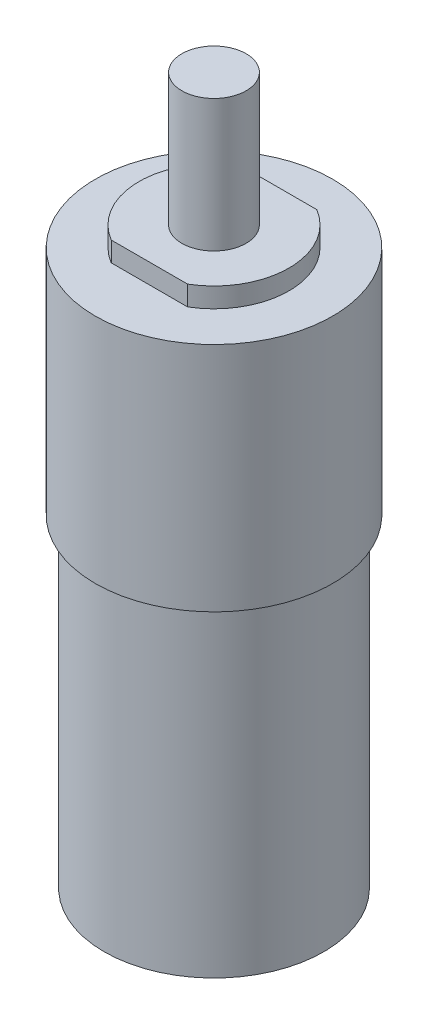
ISO-10303-21;
HEADER;
FILE_DESCRIPTION(('STEP AP214'),'2;1');
FILE_NAME('part.step','',(''),(''),'','','');
FILE_SCHEMA(('AUTOMOTIVE_DESIGN { 1 0 10303 214 1 1 1 1 }'));
ENDSEC;
DATA;
#1=APPLICATION_CONTEXT('core data for automotive mechanical design processes');
#2=APPLICATION_PROTOCOL_DEFINITION('international standard','automotive_design',2000,#1);
#3=PRODUCT_CONTEXT('',#1,'mechanical');
#4=PRODUCT('Part','Part','',(#3));
#5=PRODUCT_RELATED_PRODUCT_CATEGORY('part','',(#4));
#6=PRODUCT_DEFINITION_FORMATION('','',#4);
#7=PRODUCT_DEFINITION_CONTEXT('part definition',#1,'design');
#8=PRODUCT_DEFINITION('design','',#6,#7);
#9=PRODUCT_DEFINITION_SHAPE('','',#8);
#10=(LENGTH_UNIT() NAMED_UNIT(*) SI_UNIT(.MILLI.,.METRE.));
#11=(NAMED_UNIT(*) PLANE_ANGLE_UNIT() SI_UNIT($,.RADIAN.));
#12=(NAMED_UNIT(*) SI_UNIT($,.STERADIAN.) SOLID_ANGLE_UNIT());
#13=UNCERTAINTY_MEASURE_WITH_UNIT(LENGTH_MEASURE(1.E-05),#10,'distance_accuracy_value','');
#14=(GEOMETRIC_REPRESENTATION_CONTEXT(3) GLOBAL_UNCERTAINTY_ASSIGNED_CONTEXT((#13)) GLOBAL_UNIT_ASSIGNED_CONTEXT((#10,
#11,#12)) REPRESENTATION_CONTEXT('',''));
#15=CARTESIAN_POINT('',(0.,0.,0.));
#16=DIRECTION('',(0.,0.,1.));
#17=DIRECTION('',(1.,0.,0.));
#18=AXIS2_PLACEMENT_3D('',#15,#16,#17);
#19=CARTESIAN_POINT('',(0.,53.1368,0.));
#20=DIRECTION('',(0.,-1.,0.));
#21=DIRECTION('',(0.,0.,-1.));
#22=AXIS2_PLACEMENT_3D('',#19,#20,#21);
#23=CYLINDRICAL_SURFACE('',#22,6.9342);
#24=CARTESIAN_POINT('',(0.,53.1368,0.));
#25=DIRECTION('',(0.,1.,0.));
#26=DIRECTION('',(0.,0.,1.));
#27=AXIS2_PLACEMENT_3D('',#24,#25,#26);
#28=CIRCLE('',#27,6.9342);
#29=CARTESIAN_POINT('',(-3.52904642077715,53.1368,-5.969));
#30=VERTEX_POINT('',#29);
#31=CARTESIAN_POINT('',(-3.5290464207772,53.1368,5.969));
#32=VERTEX_POINT('',#31);
#33=EDGE_CURVE('E98',#30,#32,#28,.T.);
#34=ORIENTED_EDGE('',*,*,#33,.F.);
#35=DIRECTION('',(0.,1.,0.));
#36=VECTOR('',#35,1.);
#37=CARTESIAN_POINT('',(-3.5290464207772,44.1842169039195,-5.969));
#38=LINE('',#37,#36);
#39=CARTESIAN_POINT('',(-3.5290464207772,51.308,-5.969));
#40=VERTEX_POINT('',#39);
#41=EDGE_CURVE('E53',#40,#30,#38,.T.);
#42=ORIENTED_EDGE('',*,*,#41,.F.);
#43=CARTESIAN_POINT('',(0.,51.308,0.));
#44=DIRECTION('',(0.,1.,0.));
#45=DIRECTION('',(0.,0.,1.));
#46=AXIS2_PLACEMENT_3D('',#43,#44,#45);
#47=CIRCLE('',#46,6.9342);
#48=CARTESIAN_POINT('',(-3.5290464207772,51.308,5.969));
#49=VERTEX_POINT('',#48);
#50=EDGE_CURVE('E45',#40,#49,#47,.T.);
#51=ORIENTED_EDGE('',*,*,#50,.T.);
#52=DIRECTION('',(0.,1.,0.));
#53=VECTOR('',#52,1.);
#54=CARTESIAN_POINT('',(-3.5290464207772,44.1842169039195,5.969));
#55=LINE('',#54,#53);
#56=EDGE_CURVE('E163',#49,#32,#55,.T.);
#57=ORIENTED_EDGE('',*,*,#56,.T.);
#58=EDGE_LOOP('',(#34,#42,#51,#57));
#59=FACE_BOUND('',#58,.T.);
#60=ADVANCED_FACE('F36',(#59),#23,.T.);
#61=CARTESIAN_POINT('',(0.,29.8958,0.));
#62=DIRECTION('',(0.,-1.,0.));
#63=DIRECTION('',(0.,0.,-1.));
#64=AXIS2_PLACEMENT_3D('',#61,#62,#63);
#65=CYLINDRICAL_SURFACE('',#64,10.16);
#66=CARTESIAN_POINT('',(0.,29.8958,0.));
#67=DIRECTION('',(0.,1.,0.));
#68=DIRECTION('',(0.,0.,1.));
#69=AXIS2_PLACEMENT_3D('',#66,#67,#68);
#70=CIRCLE('',#69,10.16);
#71=CARTESIAN_POINT('',(0.,29.8958,10.16));
#72=VERTEX_POINT('',#71);
#73=EDGE_CURVE('E110',#72,#72,#70,.T.);
#74=ORIENTED_EDGE('',*,*,#73,.F.);
#75=EDGE_LOOP('',(#74));
#76=FACE_BOUND('',#75,.T.);
#77=CARTESIAN_POINT('',(0.,0.,0.));
#78=DIRECTION('',(0.,1.,0.));
#79=DIRECTION('',(0.,0.,1.));
#80=AXIS2_PLACEMENT_3D('',#77,#78,#79);
#81=CIRCLE('',#80,10.16);
#82=CARTESIAN_POINT('',(0.,0.,10.16));
#83=VERTEX_POINT('',#82);
#84=EDGE_CURVE('E108',#83,#83,#81,.T.);
#85=ORIENTED_EDGE('',*,*,#84,.T.);
#86=EDGE_LOOP('',(#85));
#87=FACE_BOUND('',#86,.T.);
#88=ADVANCED_FACE('F38',(#76,#87),#65,.T.);
#89=CARTESIAN_POINT('',(0.,0.,0.));
#90=DIRECTION('',(0.,1.,0.));
#91=DIRECTION('',(0.,0.,1.));
#92=AXIS2_PLACEMENT_3D('',#89,#90,#91);
#93=PLANE('',#92);
#94=ORIENTED_EDGE('',*,*,#84,.F.);
#95=EDGE_LOOP('',(#94));
#96=FACE_BOUND('',#95,.T.);
#97=ADVANCED_FACE('F116',(#96),#93,.F.);
#98=CARTESIAN_POINT('',(0.,51.308,0.));
#99=DIRECTION('',(0.,-1.,0.));
#100=DIRECTION('',(0.,0.,-1.));
#101=AXIS2_PLACEMENT_3D('',#98,#99,#100);
#102=CYLINDRICAL_SURFACE('',#101,10.9728);
#103=CARTESIAN_POINT('',(0.,51.308,0.));
#104=DIRECTION('',(0.,1.,0.));
#105=DIRECTION('',(0.,0.,1.));
#106=AXIS2_PLACEMENT_3D('',#103,#104,#105);
#107=CIRCLE('',#106,10.9728);
#108=CARTESIAN_POINT('',(0.,51.308,10.9728));
#109=VERTEX_POINT('',#108);
#110=EDGE_CURVE('E101',#109,#109,#107,.T.);
#111=ORIENTED_EDGE('',*,*,#110,.F.);
#112=EDGE_LOOP('',(#111));
#113=FACE_BOUND('',#112,.T.);
#114=CARTESIAN_POINT('',(0.,29.8958,0.));
#115=DIRECTION('',(0.,1.,0.));
#116=DIRECTION('',(0.,0.,1.));
#117=AXIS2_PLACEMENT_3D('',#114,#115,#116);
#118=CIRCLE('',#117,10.9728);
#119=CARTESIAN_POINT('',(0.,29.8958,10.9728));
#120=VERTEX_POINT('',#119);
#121=EDGE_CURVE('E97',#120,#120,#118,.T.);
#122=ORIENTED_EDGE('',*,*,#121,.T.);
#123=EDGE_LOOP('',(#122));
#124=FACE_BOUND('',#123,.T.);
#125=ADVANCED_FACE('F118',(#113,#124),#102,.T.);
#126=CARTESIAN_POINT('',(0.,51.308,0.));
#127=DIRECTION('',(0.,1.,0.));
#128=DIRECTION('',(0.,0.,1.));
#129=AXIS2_PLACEMENT_3D('',#126,#127,#128);
#130=PLANE('',#129);
#131=CARTESIAN_POINT('',(3.5290464207772,51.308,5.969));
#132=VERTEX_POINT('',#131);
#133=CARTESIAN_POINT('',(3.5290464207772,51.308,-5.969));
#134=VERTEX_POINT('',#133);
#135=EDGE_CURVE('E11',#132,#134,#47,.T.);
#136=ORIENTED_EDGE('',*,*,#135,.F.);
#137=DIRECTION('',(1.,0.,0.));
#138=VECTOR('',#137,1.);
#139=CARTESIAN_POINT('',(3.5290464207772,51.308,5.969));
#140=LINE('',#139,#138);
#141=EDGE_CURVE('E85',#49,#132,#140,.T.);
#142=ORIENTED_EDGE('',*,*,#141,.F.);
#143=ORIENTED_EDGE('',*,*,#50,.F.);
#144=DIRECTION('',(-1.,0.,0.));
#145=VECTOR('',#144,1.);
#146=CARTESIAN_POINT('',(-3.5290464207772,51.308,-5.969));
#147=LINE('',#146,#145);
#148=EDGE_CURVE('E92',#134,#40,#147,.T.);
#149=ORIENTED_EDGE('',*,*,#148,.F.);
#150=EDGE_LOOP('',(#136,#142,#143,#149));
#151=FACE_BOUND('',#150,.T.);
#152=ORIENTED_EDGE('',*,*,#110,.T.);
#153=EDGE_LOOP('',(#152));
#154=FACE_BOUND('',#153,.T.);
#155=ADVANCED_FACE('F123',(#151,#154),#130,.T.);
#156=CARTESIAN_POINT('',(0.,29.8958,0.));
#157=DIRECTION('',(0.,1.,0.));
#158=DIRECTION('',(0.,0.,1.));
#159=AXIS2_PLACEMENT_3D('',#156,#157,#158);
#160=PLANE('',#159);
#161=ORIENTED_EDGE('',*,*,#73,.T.);
#162=EDGE_LOOP('',(#161));
#163=FACE_BOUND('',#162,.T.);
#164=ORIENTED_EDGE('',*,*,#121,.F.);
#165=EDGE_LOOP('',(#164));
#166=FACE_BOUND('',#165,.T.);
#167=ADVANCED_FACE('F135',(#163,#166),#160,.F.);
#168=ORIENTED_EDGE('',*,*,#135,.T.);
#169=DIRECTION('',(0.,1.,0.));
#170=VECTOR('',#169,1.);
#171=CARTESIAN_POINT('',(3.5290464207772,44.1842169039195,-5.969));
#172=LINE('',#171,#170);
#173=CARTESIAN_POINT('',(3.5290464207772,53.1368,-5.969));
#174=VERTEX_POINT('',#173);
#175=EDGE_CURVE('E79',#134,#174,#172,.T.);
#176=ORIENTED_EDGE('',*,*,#175,.T.);
#177=CARTESIAN_POINT('',(3.52904642077715,53.1368,5.969));
#178=VERTEX_POINT('',#177);
#179=EDGE_CURVE('E90',#178,#174,#28,.T.);
#180=ORIENTED_EDGE('',*,*,#179,.F.);
#181=DIRECTION('',(0.,1.,0.));
#182=VECTOR('',#181,1.);
#183=CARTESIAN_POINT('',(3.5290464207772,44.1842169039195,5.969));
#184=LINE('',#183,#182);
#185=EDGE_CURVE('E61',#132,#178,#184,.T.);
#186=ORIENTED_EDGE('',*,*,#185,.F.);
#187=EDGE_LOOP('',(#168,#176,#180,#186));
#188=FACE_BOUND('',#187,.T.);
#189=ADVANCED_FACE('F89',(#188),#23,.T.);
#190=CARTESIAN_POINT('',(0.,53.1368,0.));
#191=DIRECTION('',(0.,1.,0.));
#192=DIRECTION('',(0.,0.,1.));
#193=AXIS2_PLACEMENT_3D('',#190,#191,#192);
#194=PLANE('',#193);
#195=DIRECTION('',(1.,0.,0.));
#196=VECTOR('',#195,1.);
#197=CARTESIAN_POINT('',(-3.5290464207772,53.1368,-5.969));
#198=LINE('',#197,#196);
#199=EDGE_CURVE('E76',#30,#174,#198,.T.);
#200=ORIENTED_EDGE('',*,*,#199,.F.);
#201=ORIENTED_EDGE('',*,*,#33,.T.);
#202=DIRECTION('',(-1.,0.,0.));
#203=VECTOR('',#202,1.);
#204=CARTESIAN_POINT('',(3.5290464207772,53.1368,5.969));
#205=LINE('',#204,#203);
#206=EDGE_CURVE('E96',#178,#32,#205,.T.);
#207=ORIENTED_EDGE('',*,*,#206,.F.);
#208=ORIENTED_EDGE('',*,*,#179,.T.);
#209=EDGE_LOOP('',(#200,#201,#207,#208));
#210=FACE_BOUND('',#209,.T.);
#211=CARTESIAN_POINT('',(0.,53.1368,0.));
#212=DIRECTION('',(0.,1.,0.));
#213=DIRECTION('',(0.,0.,1.));
#214=AXIS2_PLACEMENT_3D('',#211,#212,#213);
#215=CIRCLE('',#214,2.9718);
#216=CARTESIAN_POINT('',(0.,53.1368,2.9718));
#217=VERTEX_POINT('',#216);
#218=EDGE_CURVE('E40',#217,#217,#215,.F.);
#219=ORIENTED_EDGE('',*,*,#218,.T.);
#220=EDGE_LOOP('',(#219));
#221=FACE_BOUND('',#220,.T.);
#222=ADVANCED_FACE('F94',(#210,#221),#194,.T.);
#223=CARTESIAN_POINT('',(0.,65.3542,0.));
#224=DIRECTION('',(0.,-1.,0.));
#225=DIRECTION('',(0.,0.,-1.));
#226=AXIS2_PLACEMENT_3D('',#223,#224,#225);
#227=CYLINDRICAL_SURFACE('',#226,2.9718);
#228=ORIENTED_EDGE('',*,*,#218,.F.);
#229=EDGE_LOOP('',(#228));
#230=FACE_BOUND('',#229,.T.);
#231=CARTESIAN_POINT('',(0.,65.3542,0.));
#232=DIRECTION('',(0.,1.,0.));
#233=DIRECTION('',(0.,0.,1.));
#234=AXIS2_PLACEMENT_3D('',#231,#232,#233);
#235=CIRCLE('',#234,2.9718);
#236=CARTESIAN_POINT('',(0.,65.3542,2.9718));
#237=VERTEX_POINT('',#236);
#238=EDGE_CURVE('E104',#237,#237,#235,.T.);
#239=ORIENTED_EDGE('',*,*,#238,.F.);
#240=EDGE_LOOP('',(#239));
#241=FACE_BOUND('',#240,.T.);
#242=ADVANCED_FACE('F140',(#230,#241),#227,.T.);
#243=CARTESIAN_POINT('',(0.,65.3542,0.));
#244=DIRECTION('',(0.,1.,0.));
#245=DIRECTION('',(0.,0.,1.));
#246=AXIS2_PLACEMENT_3D('',#243,#244,#245);
#247=PLANE('',#246);
#248=ORIENTED_EDGE('',*,*,#238,.T.);
#249=EDGE_LOOP('',(#248));
#250=FACE_BOUND('',#249,.T.);
#251=ADVANCED_FACE('F168',(#250),#247,.T.);
#252=CARTESIAN_POINT('',(3.5290464207772,44.1842169039195,5.969));
#253=DIRECTION('',(0.,0.,-1.));
#254=DIRECTION('',(-1.,0.,0.));
#255=AXIS2_PLACEMENT_3D('',#252,#253,#254);
#256=PLANE('',#255);
#257=ORIENTED_EDGE('',*,*,#141,.T.);
#258=ORIENTED_EDGE('',*,*,#185,.T.);
#259=ORIENTED_EDGE('',*,*,#206,.T.);
#260=ORIENTED_EDGE('',*,*,#56,.F.);
#261=EDGE_LOOP('',(#257,#258,#259,#260));
#262=FACE_BOUND('',#261,.T.);
#263=ADVANCED_FACE('F166',(#262),#256,.F.);
#264=CARTESIAN_POINT('',(-3.5290464207772,44.1842169039195,-5.969));
#265=DIRECTION('',(0.,0.,1.));
#266=DIRECTION('',(1.,0.,0.));
#267=AXIS2_PLACEMENT_3D('',#264,#265,#266);
#268=PLANE('',#267);
#269=ORIENTED_EDGE('',*,*,#148,.T.);
#270=ORIENTED_EDGE('',*,*,#41,.T.);
#271=ORIENTED_EDGE('',*,*,#199,.T.);
#272=ORIENTED_EDGE('',*,*,#175,.F.);
#273=EDGE_LOOP('',(#269,#270,#271,#272));
#274=FACE_BOUND('',#273,.T.);
#275=ADVANCED_FACE('F78',(#274),#268,.F.);
#276=CLOSED_SHELL('',(#60,#88,#97,#125,#155,#167,#189,#222,#242,#251,#263,#275));
#277=MANIFOLD_SOLID_BREP('B2',#276);
#278=ADVANCED_BREP_SHAPE_REPRESENTATION('',(#18,#277),#14);
#279=SHAPE_DEFINITION_REPRESENTATION(#9,#278);
ENDSEC;
END-ISO-10303-21;
